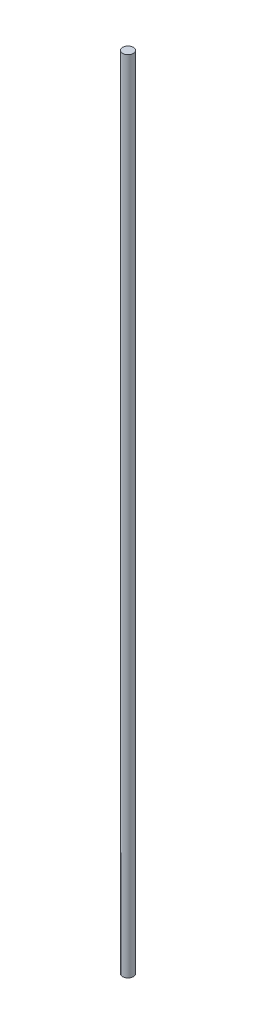
ISO-10303-21;
HEADER;
FILE_DESCRIPTION(('STEP AP214'),'2;1');
FILE_NAME('part.step','',(''),(''),'','','');
FILE_SCHEMA(('AUTOMOTIVE_DESIGN { 1 0 10303 214 1 1 1 1 }'));
ENDSEC;
DATA;
#1=APPLICATION_CONTEXT('core data for automotive mechanical design processes');
#2=APPLICATION_PROTOCOL_DEFINITION('international standard','automotive_design',2000,#1);
#3=PRODUCT_CONTEXT('',#1,'mechanical');
#4=PRODUCT('Part','Part','',(#3));
#5=PRODUCT_RELATED_PRODUCT_CATEGORY('part','',(#4));
#6=PRODUCT_DEFINITION_FORMATION('','',#4);
#7=PRODUCT_DEFINITION_CONTEXT('part definition',#1,'design');
#8=PRODUCT_DEFINITION('design','',#6,#7);
#9=PRODUCT_DEFINITION_SHAPE('','',#8);
#10=(LENGTH_UNIT() NAMED_UNIT(*) SI_UNIT(.MILLI.,.METRE.));
#11=(NAMED_UNIT(*) PLANE_ANGLE_UNIT() SI_UNIT($,.RADIAN.));
#12=(NAMED_UNIT(*) SI_UNIT($,.STERADIAN.) SOLID_ANGLE_UNIT());
#13=UNCERTAINTY_MEASURE_WITH_UNIT(LENGTH_MEASURE(1.E-05),#10,'distance_accuracy_value','');
#14=(GEOMETRIC_REPRESENTATION_CONTEXT(3) GLOBAL_UNCERTAINTY_ASSIGNED_CONTEXT((#13)) GLOBAL_UNIT_ASSIGNED_CONTEXT((#10,
#11,#12)) REPRESENTATION_CONTEXT('',''));
#15=CARTESIAN_POINT('',(0.,0.,0.));
#16=DIRECTION('',(0.,0.,1.));
#17=DIRECTION('',(1.,0.,0.));
#18=AXIS2_PLACEMENT_3D('',#15,#16,#17);
#19=CARTESIAN_POINT('',(200.,-300.,0.));
#20=DIRECTION('',(0.,1.,0.));
#21=DIRECTION('',(0.,0.,1.));
#22=AXIS2_PLACEMENT_3D('',#19,#20,#21);
#23=CYLINDRICAL_SURFACE('',#22,2.);
#24=CARTESIAN_POINT('',(200.,-300.,0.));
#25=DIRECTION('',(0.,1.,0.));
#26=DIRECTION('',(0.,0.,1.));
#27=AXIS2_PLACEMENT_3D('',#24,#25,#26);
#28=CIRCLE('',#27,2.);
#29=CARTESIAN_POINT('',(200.,-300.,2.));
#30=VERTEX_POINT('',#29);
#31=EDGE_CURVE('E10',#30,#30,#28,.T.);
#32=ORIENTED_EDGE('',*,*,#31,.T.);
#33=EDGE_LOOP('',(#32));
#34=FACE_BOUND('',#33,.T.);
#35=CARTESIAN_POINT('',(200.,0.,0.));
#36=DIRECTION('',(0.,1.,0.));
#37=DIRECTION('',(0.,0.,1.));
#38=AXIS2_PLACEMENT_3D('',#35,#36,#37);
#39=CIRCLE('',#38,2.);
#40=CARTESIAN_POINT('',(200.,0.,2.));
#41=VERTEX_POINT('',#40);
#42=EDGE_CURVE('E37',#41,#41,#39,.T.);
#43=ORIENTED_EDGE('',*,*,#42,.F.);
#44=EDGE_LOOP('',(#43));
#45=FACE_BOUND('',#44,.T.);
#46=ADVANCED_FACE('F31',(#34,#45),#23,.T.);
#47=CARTESIAN_POINT('',(202.,-300.,0.));
#48=DIRECTION('',(0.,-1.,0.));
#49=DIRECTION('',(0.,0.,-1.));
#50=AXIS2_PLACEMENT_3D('',#47,#48,#49);
#51=PLANE('',#50);
#52=ORIENTED_EDGE('',*,*,#31,.F.);
#53=EDGE_LOOP('',(#52));
#54=FACE_BOUND('',#53,.T.);
#55=ADVANCED_FACE('F46',(#54),#51,.T.);
#56=CARTESIAN_POINT('',(200.,0.,0.));
#57=DIRECTION('',(0.,1.,0.));
#58=DIRECTION('',(0.,0.,1.));
#59=AXIS2_PLACEMENT_3D('',#56,#57,#58);
#60=PLANE('',#59);
#61=ORIENTED_EDGE('',*,*,#42,.T.);
#62=EDGE_LOOP('',(#61));
#63=FACE_BOUND('',#62,.T.);
#64=ADVANCED_FACE('F43',(#63),#60,.T.);
#65=CLOSED_SHELL('',(#46,#55,#64));
#66=MANIFOLD_SOLID_BREP('B2',#65);
#67=ADVANCED_BREP_SHAPE_REPRESENTATION('',(#18,#66),#14);
#68=SHAPE_DEFINITION_REPRESENTATION(#9,#67);
ENDSEC;
END-ISO-10303-21;
